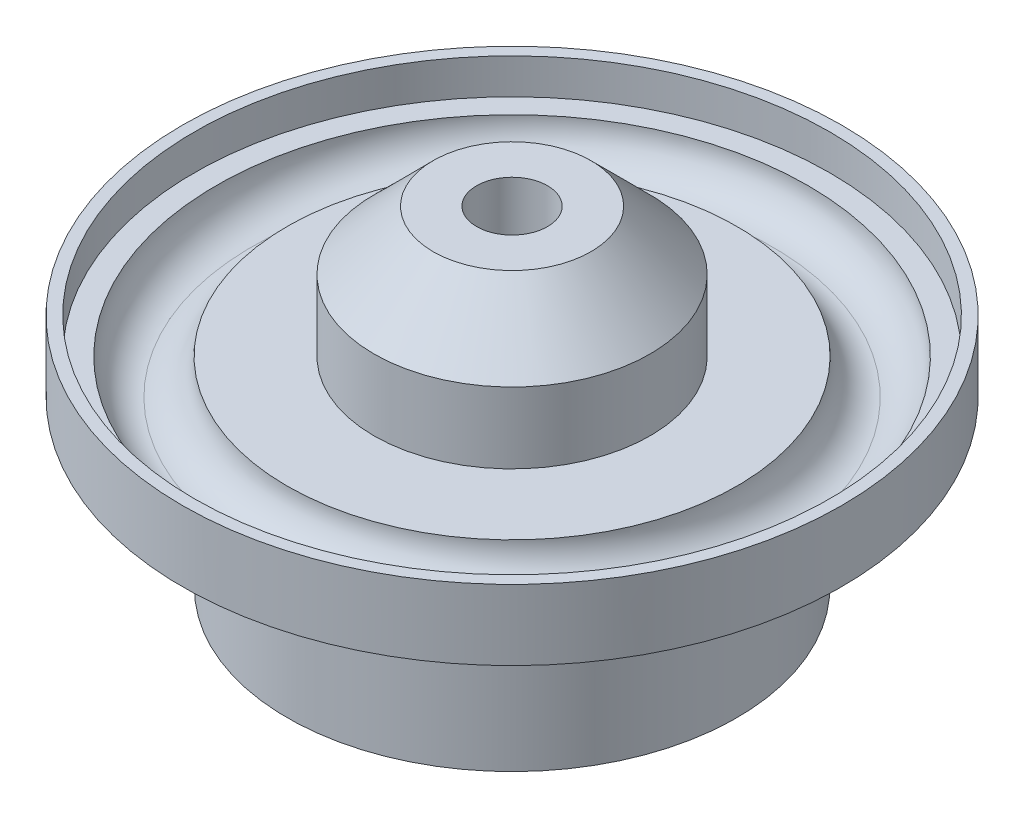
ISO-10303-21;
HEADER;
FILE_DESCRIPTION(('STEP AP214'),'2;1');
FILE_NAME('part.step','',(''),(''),'','','');
FILE_SCHEMA(('AUTOMOTIVE_DESIGN { 1 0 10303 214 1 1 1 1 }'));
ENDSEC;
DATA;
#1=APPLICATION_CONTEXT('core data for automotive mechanical design processes');
#2=APPLICATION_PROTOCOL_DEFINITION('international standard','automotive_design',2000,#1);
#3=PRODUCT_CONTEXT('',#1,'mechanical');
#4=PRODUCT('Part','Part','',(#3));
#5=PRODUCT_RELATED_PRODUCT_CATEGORY('part','',(#4));
#6=PRODUCT_DEFINITION_FORMATION('','',#4);
#7=PRODUCT_DEFINITION_CONTEXT('part definition',#1,'design');
#8=PRODUCT_DEFINITION('design','',#6,#7);
#9=PRODUCT_DEFINITION_SHAPE('','',#8);
#10=(LENGTH_UNIT() NAMED_UNIT(*) SI_UNIT(.MILLI.,.METRE.));
#11=(NAMED_UNIT(*) PLANE_ANGLE_UNIT() SI_UNIT($,.RADIAN.));
#12=(NAMED_UNIT(*) SI_UNIT($,.STERADIAN.) SOLID_ANGLE_UNIT());
#13=UNCERTAINTY_MEASURE_WITH_UNIT(LENGTH_MEASURE(1.E-05),#10,'distance_accuracy_value','');
#14=(GEOMETRIC_REPRESENTATION_CONTEXT(3) GLOBAL_UNCERTAINTY_ASSIGNED_CONTEXT((#13)) GLOBAL_UNIT_ASSIGNED_CONTEXT((#10,
#11,#12)) REPRESENTATION_CONTEXT('',''));
#15=CARTESIAN_POINT('',(0.,0.,0.));
#16=DIRECTION('',(0.,0.,1.));
#17=DIRECTION('',(1.,0.,0.));
#18=AXIS2_PLACEMENT_3D('',#15,#16,#17);
#19=CARTESIAN_POINT('',(0.,0.,0.));
#20=DIRECTION('',(0.,1.,0.));
#21=DIRECTION('',(0.,0.,1.));
#22=AXIS2_PLACEMENT_3D('',#19,#20,#21);
#23=PLANE('',#22);
#24=CARTESIAN_POINT('',(0.,0.,0.));
#25=DIRECTION('',(0.,1.,0.));
#26=DIRECTION('',(0.,0.,1.));
#27=AXIS2_PLACEMENT_3D('',#24,#25,#26);
#28=CIRCLE('',#27,3.);
#29=CARTESIAN_POINT('',(0.,0.,3.));
#30=VERTEX_POINT('',#29);
#31=EDGE_CURVE('E65',#30,#30,#28,.T.);
#32=ORIENTED_EDGE('',*,*,#31,.T.);
#33=EDGE_LOOP('',(#32));
#34=FACE_BOUND('',#33,.T.);
#35=CARTESIAN_POINT('',(0.,0.,0.));
#36=DIRECTION('',(0.,-1.,0.));
#37=DIRECTION('',(0.,0.,-1.));
#38=AXIS2_PLACEMENT_3D('',#35,#36,#37);
#39=CIRCLE('',#38,19.0099105134831);
#40=CARTESIAN_POINT('',(0.,0.,-19.0099105134831));
#41=VERTEX_POINT('',#40);
#42=EDGE_CURVE('E79',#41,#41,#39,.T.);
#43=ORIENTED_EDGE('',*,*,#42,.T.);
#44=EDGE_LOOP('',(#43));
#45=FACE_BOUND('',#44,.T.);
#46=ADVANCED_FACE('F31',(#34,#45),#23,.F.);
#47=CARTESIAN_POINT('',(0.,20.,0.));
#48=DIRECTION('',(0.,-1.,0.));
#49=DIRECTION('',(0.,0.,-1.));
#50=AXIS2_PLACEMENT_3D('',#47,#48,#49);
#51=CYLINDRICAL_SURFACE('',#50,27.8896082244549);
#52=CARTESIAN_POINT('',(0.,14.0470511010546,0.));
#53=DIRECTION('',(0.,-1.,0.));
#54=DIRECTION('',(0.,0.,-1.));
#55=AXIS2_PLACEMENT_3D('',#52,#53,#54);
#56=CIRCLE('',#55,27.8896082244549);
#57=CARTESIAN_POINT('',(0.,14.0470511010546,-27.8896082244549));
#58=VERTEX_POINT('',#57);
#59=EDGE_CURVE('E10',#58,#58,#56,.F.);
#60=ORIENTED_EDGE('',*,*,#59,.T.);
#61=EDGE_LOOP('',(#60));
#62=FACE_BOUND('',#61,.T.);
#63=CARTESIAN_POINT('',(0.,20.,0.));
#64=DIRECTION('',(0.,1.,0.));
#65=DIRECTION('',(0.,0.,1.));
#66=AXIS2_PLACEMENT_3D('',#63,#64,#65);
#67=CIRCLE('',#66,27.8896082244549);
#68=CARTESIAN_POINT('',(0.,20.,27.8896082244549));
#69=VERTEX_POINT('',#68);
#70=EDGE_CURVE('E51',#69,#69,#67,.T.);
#71=ORIENTED_EDGE('',*,*,#70,.F.);
#72=EDGE_LOOP('',(#71));
#73=FACE_BOUND('',#72,.T.);
#74=ADVANCED_FACE('F102',(#62,#73),#51,.T.);
#75=CARTESIAN_POINT('',(0.,17.,0.));
#76=DIRECTION('',(0.,1.,0.));
#77=DIRECTION('',(0.,0.,1.));
#78=AXIS2_PLACEMENT_3D('',#75,#76,#77);
#79=PLANE('',#78);
#80=CARTESIAN_POINT('',(0.,17.,0.));
#81=DIRECTION('',(0.,1.,0.));
#82=DIRECTION('',(0.,0.,1.));
#83=AXIS2_PLACEMENT_3D('',#80,#81,#82);
#84=CIRCLE('',#83,19.0318265882376);
#85=CARTESIAN_POINT('',(0.,17.,19.0318265882376));
#86=VERTEX_POINT('',#85);
#87=EDGE_CURVE('E57',#86,#86,#84,.T.);
#88=ORIENTED_EDGE('',*,*,#87,.T.);
#89=EDGE_LOOP('',(#88));
#90=FACE_BOUND('',#89,.T.);
#91=CARTESIAN_POINT('',(0.,17.,0.));
#92=DIRECTION('',(0.,1.,0.));
#93=DIRECTION('',(0.,0.,1.));
#94=AXIS2_PLACEMENT_3D('',#91,#92,#93);
#95=CIRCLE('',#94,11.6781189687356);
#96=CARTESIAN_POINT('',(0.,17.,11.6781189687356));
#97=VERTEX_POINT('',#96);
#98=EDGE_CURVE('E56',#97,#97,#95,.T.);
#99=ORIENTED_EDGE('',*,*,#98,.F.);
#100=EDGE_LOOP('',(#99));
#101=FACE_BOUND('',#100,.T.);
#102=ADVANCED_FACE('F110',(#90,#101),#79,.T.);
#103=CARTESIAN_POINT('',(0.,20.,0.));
#104=DIRECTION('',(0.,-1.,0.));
#105=DIRECTION('',(0.,0.,-1.));
#106=AXIS2_PLACEMENT_3D('',#103,#104,#105);
#107=CYLINDRICAL_SURFACE('',#106,3.);
#108=ORIENTED_EDGE('',*,*,#31,.F.);
#109=EDGE_LOOP('',(#108));
#110=FACE_BOUND('',#109,.T.);
#111=CARTESIAN_POINT('',(0.,28.,0.));
#112=DIRECTION('',(0.,1.,0.));
#113=DIRECTION('',(0.,0.,1.));
#114=AXIS2_PLACEMENT_3D('',#111,#112,#113);
#115=CIRCLE('',#114,3.);
#116=CARTESIAN_POINT('',(0.,28.,3.));
#117=VERTEX_POINT('',#116);
#118=EDGE_CURVE('E75',#117,#117,#115,.T.);
#119=ORIENTED_EDGE('',*,*,#118,.T.);
#120=EDGE_LOOP('',(#119));
#121=FACE_BOUND('',#120,.T.);
#122=ADVANCED_FACE('F139',(#110,#121),#107,.F.);
#123=CARTESIAN_POINT('',(0.,20.,0.));
#124=DIRECTION('',(0.,1.,0.));
#125=DIRECTION('',(0.,0.,1.));
#126=AXIS2_PLACEMENT_3D('',#123,#124,#125);
#127=PLANE('',#126);
#128=CARTESIAN_POINT('',(0.,20.,0.));
#129=DIRECTION('',(0.,1.,0.));
#130=DIRECTION('',(0.,0.,1.));
#131=AXIS2_PLACEMENT_3D('',#128,#129,#130);
#132=CIRCLE('',#131,26.8896082243795);
#133=CARTESIAN_POINT('',(0.,20.,26.8896082243795));
#134=VERTEX_POINT('',#133);
#135=EDGE_CURVE('E60',#134,#134,#132,.T.);
#136=ORIENTED_EDGE('',*,*,#135,.F.);
#137=EDGE_LOOP('',(#136));
#138=FACE_BOUND('',#137,.T.);
#139=ORIENTED_EDGE('',*,*,#70,.T.);
#140=EDGE_LOOP('',(#139));
#141=FACE_BOUND('',#140,.T.);
#142=ADVANCED_FACE('F114',(#138,#141),#127,.T.);
#143=CARTESIAN_POINT('',(0.,17.,0.));
#144=DIRECTION('',(0.,1.,0.));
#145=DIRECTION('',(0.,0.,1.));
#146=AXIS2_PLACEMENT_3D('',#143,#144,#145);
#147=CYLINDRICAL_SURFACE('',#146,26.8896082243795);
#148=CARTESIAN_POINT('',(0.,17.,0.));
#149=DIRECTION('',(0.,1.,0.));
#150=DIRECTION('',(0.,0.,1.));
#151=AXIS2_PLACEMENT_3D('',#148,#149,#150);
#152=CIRCLE('',#151,26.8896082243795);
#153=CARTESIAN_POINT('',(0.,17.,26.8896082243795));
#154=VERTEX_POINT('',#153);
#155=EDGE_CURVE('E68',#154,#154,#152,.T.);
#156=ORIENTED_EDGE('',*,*,#155,.F.);
#157=EDGE_LOOP('',(#156));
#158=FACE_BOUND('',#157,.T.);
#159=ORIENTED_EDGE('',*,*,#135,.T.);
#160=EDGE_LOOP('',(#159));
#161=FACE_BOUND('',#160,.T.);
#162=ADVANCED_FACE('F129',(#158,#161),#147,.F.);
#163=CARTESIAN_POINT('',(0.,17.,0.));
#164=DIRECTION('',(0.,1.,0.));
#165=DIRECTION('',(0.,0.,1.));
#166=AXIS2_PLACEMENT_3D('',#163,#164,#165);
#167=CIRCLE('',#166,25.0318265882376);
#168=CARTESIAN_POINT('',(0.,17.,25.0318265882376));
#169=VERTEX_POINT('',#168);
#170=EDGE_CURVE('E55',#169,#169,#167,.T.);
#171=ORIENTED_EDGE('',*,*,#170,.F.);
#172=EDGE_LOOP('',(#171));
#173=FACE_BOUND('',#172,.T.);
#174=ORIENTED_EDGE('',*,*,#155,.T.);
#175=EDGE_LOOP('',(#174));
#176=FACE_BOUND('',#175,.T.);
#177=ADVANCED_FACE('F124',(#173,#176),#79,.T.);
#178=CARTESIAN_POINT('',(0.,17.,0.));
#179=DIRECTION('',(0.,1.,0.));
#180=DIRECTION('',(0.,0.,1.));
#181=AXIS2_PLACEMENT_3D('',#178,#179,#180);
#182=TOROIDAL_SURFACE('',#181,22.0318265882376,3.);
#183=ORIENTED_EDGE('',*,*,#87,.F.);
#184=EDGE_LOOP('',(#183));
#185=FACE_BOUND('',#184,.T.);
#186=CARTESIAN_POINT('',(0.,14.,0.));
#187=DIRECTION('',(0.,1.,0.));
#188=DIRECTION('',(0.,0.,1.));
#189=AXIS2_PLACEMENT_3D('',#186,#187,#188);
#190=CIRCLE('',#189,22.0318265882376);
#191=CARTESIAN_POINT('',(0.,14.,22.0318265882376));
#192=VERTEX_POINT('',#191);
#193=EDGE_CURVE('E52',#192,#192,#190,.F.);
#194=ORIENTED_EDGE('',*,*,#193,.F.);
#195=EDGE_LOOP('',(#194));
#196=FACE_BOUND('',#195,.T.);
#197=ADVANCED_FACE('F121',(#185,#196),#182,.F.);
#198=CARTESIAN_POINT('',(0.,17.,0.));
#199=DIRECTION('',(0.,1.,0.));
#200=DIRECTION('',(0.,0.,1.));
#201=AXIS2_PLACEMENT_3D('',#198,#199,#200);
#202=TOROIDAL_SURFACE('',#201,22.0318265882376,3.);
#203=ORIENTED_EDGE('',*,*,#170,.T.);
#204=EDGE_LOOP('',(#203));
#205=FACE_BOUND('',#204,.T.);
#206=ORIENTED_EDGE('',*,*,#193,.T.);
#207=EDGE_LOOP('',(#206));
#208=FACE_BOUND('',#207,.T.);
#209=ADVANCED_FACE('F117',(#205,#208),#202,.F.);
#210=CARTESIAN_POINT('',(0.,28.,0.));
#211=DIRECTION('',(0.,1.,0.));
#212=DIRECTION('',(0.,0.,1.));
#213=AXIS2_PLACEMENT_3D('',#210,#211,#212);
#214=PLANE('',#213);
#215=CARTESIAN_POINT('',(0.,28.,0.));
#216=DIRECTION('',(0.,1.,0.));
#217=DIRECTION('',(0.,0.,1.));
#218=AXIS2_PLACEMENT_3D('',#215,#216,#217);
#219=CIRCLE('',#218,6.67811896873566);
#220=CARTESIAN_POINT('',(0.,28.,6.67811896873566));
#221=VERTEX_POINT('',#220);
#222=EDGE_CURVE('E46',#221,#221,#219,.T.);
#223=ORIENTED_EDGE('',*,*,#222,.T.);
#224=EDGE_LOOP('',(#223));
#225=FACE_BOUND('',#224,.T.);
#226=ORIENTED_EDGE('',*,*,#118,.F.);
#227=EDGE_LOOP('',(#226));
#228=FACE_BOUND('',#227,.T.);
#229=ADVANCED_FACE('F120',(#225,#228),#214,.T.);
#230=CARTESIAN_POINT('',(0.,28.,0.));
#231=DIRECTION('',(0.,-1.,0.));
#232=DIRECTION('',(0.,0.,-1.));
#233=AXIS2_PLACEMENT_3D('',#230,#231,#232);
#234=CYLINDRICAL_SURFACE('',#233,11.6781189687356);
#235=CARTESIAN_POINT('',(0.,23.,0.));
#236=DIRECTION('',(0.,1.,0.));
#237=DIRECTION('',(0.,0.,1.));
#238=AXIS2_PLACEMENT_3D('',#235,#236,#237);
#239=CIRCLE('',#238,11.6781189687356);
#240=CARTESIAN_POINT('',(0.,23.,11.6781189687356));
#241=VERTEX_POINT('',#240);
#242=EDGE_CURVE('E42',#241,#241,#239,.F.);
#243=ORIENTED_EDGE('',*,*,#242,.T.);
#244=EDGE_LOOP('',(#243));
#245=FACE_BOUND('',#244,.T.);
#246=ORIENTED_EDGE('',*,*,#98,.T.);
#247=EDGE_LOOP('',(#246));
#248=FACE_BOUND('',#247,.T.);
#249=ADVANCED_FACE('F98',(#245,#248),#234,.T.);
#250=CARTESIAN_POINT('',(0.,28.,0.));
#251=DIRECTION('',(0.,-1.,0.));
#252=DIRECTION('',(0.,0.,-1.));
#253=AXIS2_PLACEMENT_3D('',#250,#251,#252);
#254=CONICAL_SURFACE('',#253,6.67811896873566,0.785398163397446);
#255=ORIENTED_EDGE('',*,*,#242,.F.);
#256=EDGE_LOOP('',(#255));
#257=FACE_BOUND('',#256,.T.);
#258=ORIENTED_EDGE('',*,*,#222,.F.);
#259=EDGE_LOOP('',(#258));
#260=FACE_BOUND('',#259,.T.);
#261=ADVANCED_FACE('F90',(#257,#260),#254,.T.);
#262=CARTESIAN_POINT('',(0.,10.,0.));
#263=DIRECTION('',(0.,-1.,0.));
#264=DIRECTION('',(0.,0.,-1.));
#265=AXIS2_PLACEMENT_3D('',#262,#263,#264);
#266=PLANE('',#265);
#267=CARTESIAN_POINT('',(0.,10.,0.));
#268=DIRECTION('',(0.,-1.,0.));
#269=DIRECTION('',(0.,0.,-1.));
#270=AXIS2_PLACEMENT_3D('',#267,#268,#269);
#271=CIRCLE('',#270,21.8896082244549);
#272=CARTESIAN_POINT('',(0.,10.,-21.8896082244549));
#273=VERTEX_POINT('',#272);
#274=EDGE_CURVE('E38',#273,#273,#271,.T.);
#275=ORIENTED_EDGE('',*,*,#274,.T.);
#276=EDGE_LOOP('',(#275));
#277=FACE_BOUND('',#276,.T.);
#278=CARTESIAN_POINT('',(0.,10.,0.));
#279=DIRECTION('',(0.,-1.,0.));
#280=DIRECTION('',(0.,0.,-1.));
#281=AXIS2_PLACEMENT_3D('',#278,#279,#280);
#282=CIRCLE('',#281,19.0099105134831);
#283=CARTESIAN_POINT('',(0.,10.,-19.0099105134831));
#284=VERTEX_POINT('',#283);
#285=EDGE_CURVE('E78',#284,#284,#282,.T.);
#286=ORIENTED_EDGE('',*,*,#285,.F.);
#287=EDGE_LOOP('',(#286));
#288=FACE_BOUND('',#287,.T.);
#289=ADVANCED_FACE('F88',(#277,#288),#266,.T.);
#290=CARTESIAN_POINT('',(0.,10.,0.));
#291=DIRECTION('',(0.,-1.,0.));
#292=DIRECTION('',(0.,0.,-1.));
#293=AXIS2_PLACEMENT_3D('',#290,#291,#292);
#294=CYLINDRICAL_SURFACE('',#293,19.0099105134831);
#295=ORIENTED_EDGE('',*,*,#285,.T.);
#296=EDGE_LOOP('',(#295));
#297=FACE_BOUND('',#296,.T.);
#298=ORIENTED_EDGE('',*,*,#42,.F.);
#299=EDGE_LOOP('',(#298));
#300=FACE_BOUND('',#299,.T.);
#301=ADVANCED_FACE('F85',(#297,#300),#294,.T.);
#302=CARTESIAN_POINT('',(0.,10.,0.));
#303=DIRECTION('',(0.,1.,0.));
#304=DIRECTION('',(0.,0.,1.));
#305=AXIS2_PLACEMENT_3D('',#302,#303,#304);
#306=CONICAL_SURFACE('',#305,21.8896082244549,0.977384381116827);
#307=ORIENTED_EDGE('',*,*,#59,.F.);
#308=EDGE_LOOP('',(#307));
#309=FACE_BOUND('',#308,.T.);
#310=ORIENTED_EDGE('',*,*,#274,.F.);
#311=EDGE_LOOP('',(#310));
#312=FACE_BOUND('',#311,.T.);
#313=ADVANCED_FACE('F33',(#309,#312),#306,.T.);
#314=CLOSED_SHELL('',(#46,#74,#102,#122,#142,#162,#177,#197,#209,#229,#249,#261,#289,#301,#313));
#315=MANIFOLD_SOLID_BREP('B2',#314);
#316=ADVANCED_BREP_SHAPE_REPRESENTATION('',(#18,#315),#14);
#317=SHAPE_DEFINITION_REPRESENTATION(#9,#316);
ENDSEC;
END-ISO-10303-21;
